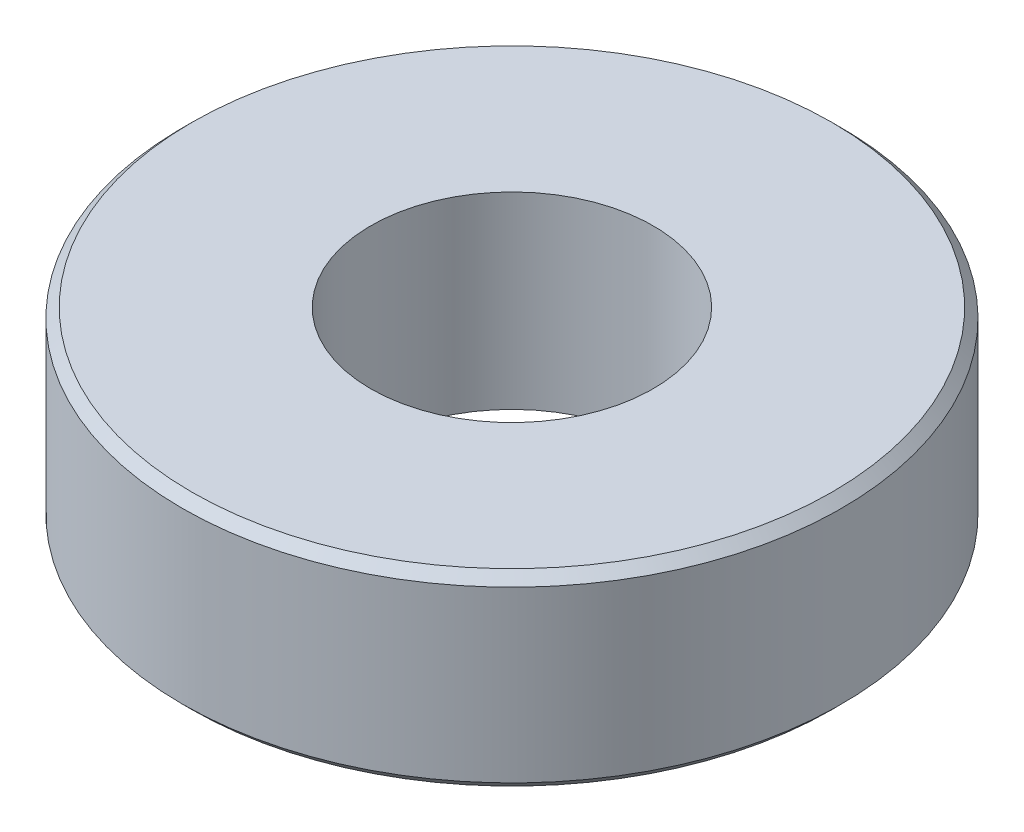
ISO-10303-21;
HEADER;
FILE_DESCRIPTION(('STEP AP214'),'2;1');
FILE_NAME('part.step','',(''),(''),'','','');
FILE_SCHEMA(('AUTOMOTIVE_DESIGN { 1 0 10303 214 1 1 1 1 }'));
ENDSEC;
DATA;
#1=APPLICATION_CONTEXT('core data for automotive mechanical design processes');
#2=APPLICATION_PROTOCOL_DEFINITION('international standard','automotive_design',2000,#1);
#3=PRODUCT_CONTEXT('',#1,'mechanical');
#4=PRODUCT('Part','Part','',(#3));
#5=PRODUCT_RELATED_PRODUCT_CATEGORY('part','',(#4));
#6=PRODUCT_DEFINITION_FORMATION('','',#4);
#7=PRODUCT_DEFINITION_CONTEXT('part definition',#1,'design');
#8=PRODUCT_DEFINITION('design','',#6,#7);
#9=PRODUCT_DEFINITION_SHAPE('','',#8);
#10=(LENGTH_UNIT() NAMED_UNIT(*) SI_UNIT(.MILLI.,.METRE.));
#11=(NAMED_UNIT(*) PLANE_ANGLE_UNIT() SI_UNIT($,.RADIAN.));
#12=(NAMED_UNIT(*) SI_UNIT($,.STERADIAN.) SOLID_ANGLE_UNIT());
#13=UNCERTAINTY_MEASURE_WITH_UNIT(LENGTH_MEASURE(1.E-05),#10,'distance_accuracy_value','');
#14=(GEOMETRIC_REPRESENTATION_CONTEXT(3) GLOBAL_UNCERTAINTY_ASSIGNED_CONTEXT((#13)) GLOBAL_UNIT_ASSIGNED_CONTEXT((#10,
#11,#12)) REPRESENTATION_CONTEXT('',''));
#15=CARTESIAN_POINT('',(0.,0.,0.));
#16=DIRECTION('',(0.,0.,1.));
#17=DIRECTION('',(1.,0.,0.));
#18=AXIS2_PLACEMENT_3D('',#15,#16,#17);
#19=CARTESIAN_POINT('',(0.,4.,0.));
#20=DIRECTION('',(0.,1.,0.));
#21=DIRECTION('',(0.,0.,1.));
#22=AXIS2_PLACEMENT_3D('',#19,#20,#21);
#23=PLANE('',#22);
#24=CARTESIAN_POINT('',(0.,4.,0.));
#25=DIRECTION('',(0.,1.,0.));
#26=DIRECTION('',(0.,0.,1.));
#27=AXIS2_PLACEMENT_3D('',#24,#25,#26);
#28=CIRCLE('',#27,6.8);
#29=CARTESIAN_POINT('',(0.,4.,6.8));
#30=VERTEX_POINT('',#29);
#31=EDGE_CURVE('E10',#30,#30,#28,.T.);
#32=ORIENTED_EDGE('',*,*,#31,.T.);
#33=EDGE_LOOP('',(#32));
#34=FACE_BOUND('',#33,.T.);
#35=CARTESIAN_POINT('',(0.,4.,0.));
#36=DIRECTION('',(0.,1.,0.));
#37=DIRECTION('',(0.,0.,1.));
#38=AXIS2_PLACEMENT_3D('',#35,#36,#37);
#39=CIRCLE('',#38,3.);
#40=CARTESIAN_POINT('',(0.,4.,3.));
#41=VERTEX_POINT('',#40);
#42=EDGE_CURVE('E55',#41,#41,#39,.T.);
#43=ORIENTED_EDGE('',*,*,#42,.F.);
#44=EDGE_LOOP('',(#43));
#45=FACE_BOUND('',#44,.T.);
#46=ADVANCED_FACE('F34',(#34,#45),#23,.T.);
#47=CARTESIAN_POINT('',(0.,0.,0.));
#48=DIRECTION('',(0.,1.,0.));
#49=DIRECTION('',(0.,0.,1.));
#50=AXIS2_PLACEMENT_3D('',#47,#48,#49);
#51=PLANE('',#50);
#52=CARTESIAN_POINT('',(0.,0.,0.));
#53=DIRECTION('',(0.,1.,0.));
#54=DIRECTION('',(0.,0.,1.));
#55=AXIS2_PLACEMENT_3D('',#52,#53,#54);
#56=CIRCLE('',#55,6.8);
#57=CARTESIAN_POINT('',(0.,0.,6.8));
#58=VERTEX_POINT('',#57);
#59=EDGE_CURVE('E42',#58,#58,#56,.F.);
#60=ORIENTED_EDGE('',*,*,#59,.T.);
#61=EDGE_LOOP('',(#60));
#62=FACE_BOUND('',#61,.T.);
#63=CARTESIAN_POINT('',(0.,0.,0.));
#64=DIRECTION('',(0.,1.,0.));
#65=DIRECTION('',(0.,0.,1.));
#66=AXIS2_PLACEMENT_3D('',#63,#64,#65);
#67=CIRCLE('',#66,3.);
#68=CARTESIAN_POINT('',(0.,0.,3.));
#69=VERTEX_POINT('',#68);
#70=EDGE_CURVE('E56',#69,#69,#67,.T.);
#71=ORIENTED_EDGE('',*,*,#70,.T.);
#72=EDGE_LOOP('',(#71));
#73=FACE_BOUND('',#72,.T.);
#74=ADVANCED_FACE('F66',(#62,#73),#51,.F.);
#75=CARTESIAN_POINT('',(0.,4.,0.));
#76=DIRECTION('',(0.,-1.,0.));
#77=DIRECTION('',(0.,0.,-1.));
#78=AXIS2_PLACEMENT_3D('',#75,#76,#77);
#79=CYLINDRICAL_SURFACE('',#78,7.);
#80=CARTESIAN_POINT('',(0.,0.199999999999999,0.));
#81=DIRECTION('',(0.,1.,0.));
#82=DIRECTION('',(0.,0.,1.));
#83=AXIS2_PLACEMENT_3D('',#80,#81,#82);
#84=CIRCLE('',#83,7.);
#85=CARTESIAN_POINT('',(0.,0.199999999999999,7.));
#86=VERTEX_POINT('',#85);
#87=EDGE_CURVE('E46',#86,#86,#84,.T.);
#88=ORIENTED_EDGE('',*,*,#87,.T.);
#89=EDGE_LOOP('',(#88));
#90=FACE_BOUND('',#89,.T.);
#91=CARTESIAN_POINT('',(0.,3.8,0.));
#92=DIRECTION('',(0.,1.,0.));
#93=DIRECTION('',(0.,0.,1.));
#94=AXIS2_PLACEMENT_3D('',#91,#92,#93);
#95=CIRCLE('',#94,7.);
#96=CARTESIAN_POINT('',(0.,3.8,7.));
#97=VERTEX_POINT('',#96);
#98=EDGE_CURVE('E50',#97,#97,#95,.F.);
#99=ORIENTED_EDGE('',*,*,#98,.T.);
#100=EDGE_LOOP('',(#99));
#101=FACE_BOUND('',#100,.T.);
#102=ADVANCED_FACE('F71',(#90,#101),#79,.T.);
#103=CARTESIAN_POINT('',(0.,4.,0.));
#104=DIRECTION('',(0.,-1.,0.));
#105=DIRECTION('',(0.,0.,-1.));
#106=AXIS2_PLACEMENT_3D('',#103,#104,#105);
#107=CYLINDRICAL_SURFACE('',#106,3.);
#108=ORIENTED_EDGE('',*,*,#42,.T.);
#109=EDGE_LOOP('',(#108));
#110=FACE_BOUND('',#109,.T.);
#111=ORIENTED_EDGE('',*,*,#70,.F.);
#112=EDGE_LOOP('',(#111));
#113=FACE_BOUND('',#112,.T.);
#114=ADVANCED_FACE('F62',(#110,#113),#107,.F.);
#115=CARTESIAN_POINT('',(0.,0.199999999999999,0.));
#116=DIRECTION('',(0.,1.,0.));
#117=DIRECTION('',(0.,0.,1.));
#118=AXIS2_PLACEMENT_3D('',#115,#116,#117);
#119=CONICAL_SURFACE('',#118,7.,0.785398163397453);
#120=ORIENTED_EDGE('',*,*,#59,.F.);
#121=EDGE_LOOP('',(#120));
#122=FACE_BOUND('',#121,.T.);
#123=ORIENTED_EDGE('',*,*,#87,.F.);
#124=EDGE_LOOP('',(#123));
#125=FACE_BOUND('',#124,.T.);
#126=ADVANCED_FACE('F78',(#122,#125),#119,.T.);
#127=CARTESIAN_POINT('',(0.,4.,0.));
#128=DIRECTION('',(0.,-1.,0.));
#129=DIRECTION('',(0.,0.,-1.));
#130=AXIS2_PLACEMENT_3D('',#127,#128,#129);
#131=CONICAL_SURFACE('',#130,6.8,0.785398163397438);
#132=ORIENTED_EDGE('',*,*,#98,.F.);
#133=EDGE_LOOP('',(#132));
#134=FACE_BOUND('',#133,.T.);
#135=ORIENTED_EDGE('',*,*,#31,.F.);
#136=EDGE_LOOP('',(#135));
#137=FACE_BOUND('',#136,.T.);
#138=ADVANCED_FACE('F37',(#134,#137),#131,.T.);
#139=CLOSED_SHELL('',(#46,#74,#102,#114,#126,#138));
#140=MANIFOLD_SOLID_BREP('B2',#139);
#141=ADVANCED_BREP_SHAPE_REPRESENTATION('',(#18,#140),#14);
#142=SHAPE_DEFINITION_REPRESENTATION(#9,#141);
ENDSEC;
END-ISO-10303-21;
